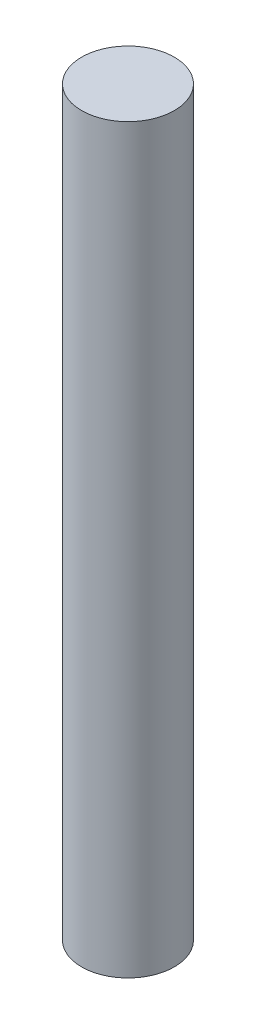
ISO-10303-21;
HEADER;
FILE_DESCRIPTION(('STEP AP214'),'2;1');
FILE_NAME('part.step','',(''),(''),'','','');
FILE_SCHEMA(('AUTOMOTIVE_DESIGN { 1 0 10303 214 1 1 1 1 }'));
ENDSEC;
DATA;
#1=APPLICATION_CONTEXT('core data for automotive mechanical design processes');
#2=APPLICATION_PROTOCOL_DEFINITION('international standard','automotive_design',2000,#1);
#3=PRODUCT_CONTEXT('',#1,'mechanical');
#4=PRODUCT('Part','Part','',(#3));
#5=PRODUCT_RELATED_PRODUCT_CATEGORY('part','',(#4));
#6=PRODUCT_DEFINITION_FORMATION('','',#4);
#7=PRODUCT_DEFINITION_CONTEXT('part definition',#1,'design');
#8=PRODUCT_DEFINITION('design','',#6,#7);
#9=PRODUCT_DEFINITION_SHAPE('','',#8);
#10=(LENGTH_UNIT() NAMED_UNIT(*) SI_UNIT(.MILLI.,.METRE.));
#11=(NAMED_UNIT(*) PLANE_ANGLE_UNIT() SI_UNIT($,.RADIAN.));
#12=(NAMED_UNIT(*) SI_UNIT($,.STERADIAN.) SOLID_ANGLE_UNIT());
#13=UNCERTAINTY_MEASURE_WITH_UNIT(LENGTH_MEASURE(1.E-05),#10,'distance_accuracy_value','');
#14=(GEOMETRIC_REPRESENTATION_CONTEXT(3) GLOBAL_UNCERTAINTY_ASSIGNED_CONTEXT((#13)) GLOBAL_UNIT_ASSIGNED_CONTEXT((#10,
#11,#12)) REPRESENTATION_CONTEXT('',''));
#15=CARTESIAN_POINT('',(0.,0.,0.));
#16=DIRECTION('',(0.,0.,1.));
#17=DIRECTION('',(1.,0.,0.));
#18=AXIS2_PLACEMENT_3D('',#15,#16,#17);
#19=CARTESIAN_POINT('',(0.,76.2,0.));
#20=DIRECTION('',(0.,-1.,0.));
#21=DIRECTION('',(0.,0.,-1.));
#22=AXIS2_PLACEMENT_3D('',#19,#20,#21);
#23=CYLINDRICAL_SURFACE('',#22,4.7625);
#24=CARTESIAN_POINT('',(0.,76.2,0.));
#25=DIRECTION('',(0.,1.,0.));
#26=DIRECTION('',(0.,0.,1.));
#27=AXIS2_PLACEMENT_3D('',#24,#25,#26);
#28=CIRCLE('',#27,4.7625);
#29=CARTESIAN_POINT('',(0.,76.2,4.7625));
#30=VERTEX_POINT('',#29);
#31=EDGE_CURVE('E10',#30,#30,#28,.T.);
#32=ORIENTED_EDGE('',*,*,#31,.F.);
#33=EDGE_LOOP('',(#32));
#34=FACE_BOUND('',#33,.T.);
#35=CARTESIAN_POINT('',(0.,0.,0.));
#36=DIRECTION('',(0.,1.,0.));
#37=DIRECTION('',(0.,0.,1.));
#38=AXIS2_PLACEMENT_3D('',#35,#36,#37);
#39=CIRCLE('',#38,4.7625);
#40=CARTESIAN_POINT('',(0.,0.,4.7625));
#41=VERTEX_POINT('',#40);
#42=EDGE_CURVE('E18',#41,#41,#39,.T.);
#43=ORIENTED_EDGE('',*,*,#42,.T.);
#44=EDGE_LOOP('',(#43));
#45=FACE_BOUND('',#44,.T.);
#46=ADVANCED_FACE('F15',(#34,#45),#23,.T.);
#47=CARTESIAN_POINT('',(0.,76.2,0.));
#48=DIRECTION('',(0.,1.,0.));
#49=DIRECTION('',(0.,0.,1.));
#50=AXIS2_PLACEMENT_3D('',#47,#48,#49);
#51=PLANE('',#50);
#52=ORIENTED_EDGE('',*,*,#31,.T.);
#53=EDGE_LOOP('',(#52));
#54=FACE_BOUND('',#53,.T.);
#55=ADVANCED_FACE('F30',(#54),#51,.T.);
#56=CARTESIAN_POINT('',(0.,0.,0.));
#57=DIRECTION('',(0.,1.,0.));
#58=DIRECTION('',(0.,0.,1.));
#59=AXIS2_PLACEMENT_3D('',#56,#57,#58);
#60=PLANE('',#59);
#61=ORIENTED_EDGE('',*,*,#42,.F.);
#62=EDGE_LOOP('',(#61));
#63=FACE_BOUND('',#62,.T.);
#64=ADVANCED_FACE('F28',(#63),#60,.F.);
#65=CLOSED_SHELL('',(#46,#55,#64));
#66=MANIFOLD_SOLID_BREP('B1',#65);
#67=ADVANCED_BREP_SHAPE_REPRESENTATION('',(#18,#66),#14);
#68=SHAPE_DEFINITION_REPRESENTATION(#9,#67);
ENDSEC;
END-ISO-10303-21;
